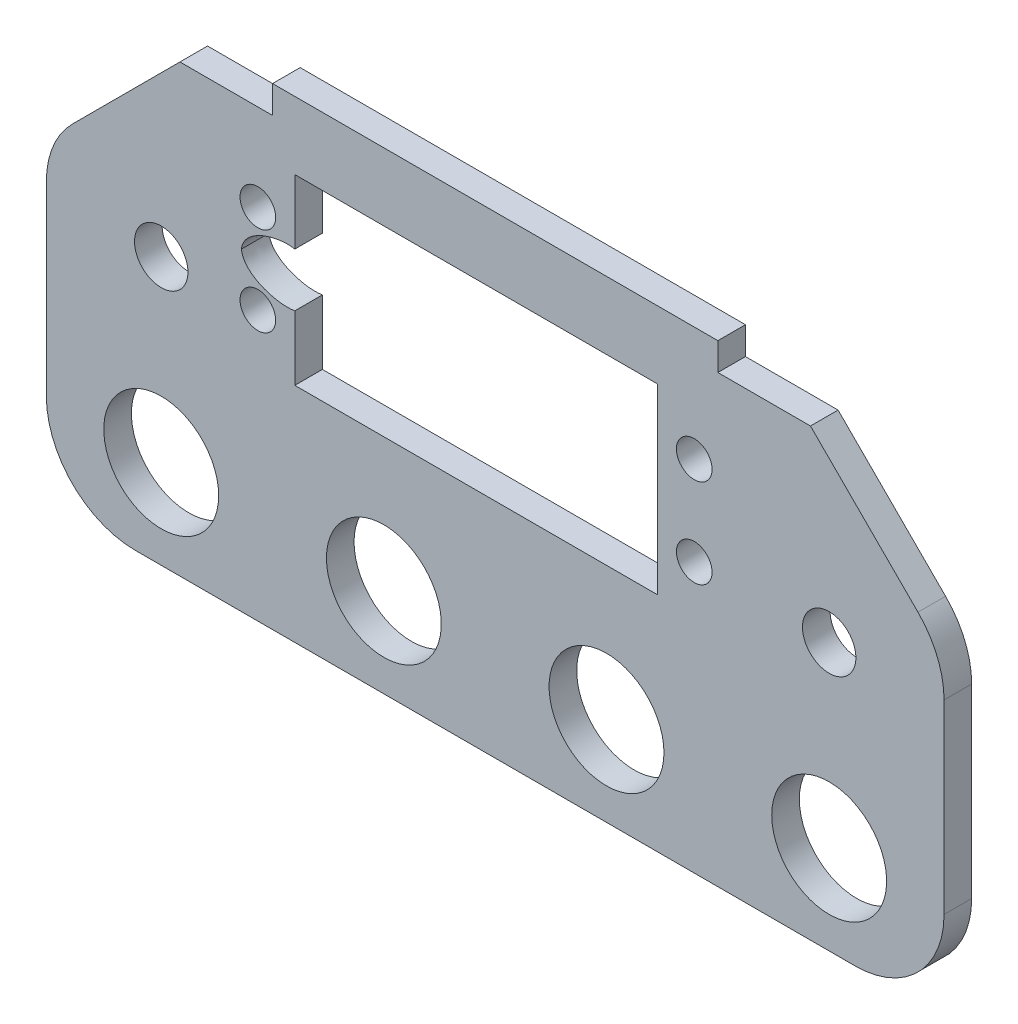
ISO-10303-21;
HEADER;
FILE_DESCRIPTION(('STEP AP214'),'2;1');
FILE_NAME('part.step','',(''),(''),'','','');
FILE_SCHEMA(('AUTOMOTIVE_DESIGN { 1 0 10303 214 1 1 1 1 }'));
ENDSEC;
DATA;
#1=APPLICATION_CONTEXT('core data for automotive mechanical design processes');
#2=APPLICATION_PROTOCOL_DEFINITION('international standard','automotive_design',2000,#1);
#3=PRODUCT_CONTEXT('',#1,'mechanical');
#4=PRODUCT('Part','Part','',(#3));
#5=PRODUCT_RELATED_PRODUCT_CATEGORY('part','',(#4));
#6=PRODUCT_DEFINITION_FORMATION('','',#4);
#7=PRODUCT_DEFINITION_CONTEXT('part definition',#1,'design');
#8=PRODUCT_DEFINITION('design','',#6,#7);
#9=PRODUCT_DEFINITION_SHAPE('','',#8);
#10=(LENGTH_UNIT() NAMED_UNIT(*) SI_UNIT(.MILLI.,.METRE.));
#11=(NAMED_UNIT(*) PLANE_ANGLE_UNIT() SI_UNIT($,.RADIAN.));
#12=(NAMED_UNIT(*) SI_UNIT($,.STERADIAN.) SOLID_ANGLE_UNIT());
#13=UNCERTAINTY_MEASURE_WITH_UNIT(LENGTH_MEASURE(1.E-05),#10,'distance_accuracy_value','');
#14=(GEOMETRIC_REPRESENTATION_CONTEXT(3) GLOBAL_UNCERTAINTY_ASSIGNED_CONTEXT((#13)) GLOBAL_UNIT_ASSIGNED_CONTEXT((#10,
#11,#12)) REPRESENTATION_CONTEXT('',''));
#15=CARTESIAN_POINT('',(0.,0.,0.));
#16=DIRECTION('',(0.,0.,1.));
#17=DIRECTION('',(1.,0.,0.));
#18=AXIS2_PLACEMENT_3D('',#15,#16,#17);
#19=CARTESIAN_POINT('',(-0.399999987385364,44.9992058139719,3.1));
#20=DIRECTION('',(0.,-1.,0.));
#21=DIRECTION('',(1.,0.,0.));
#22=AXIS2_PLACEMENT_3D('',#19,#20,#21);
#23=PLANE('',#22);
#24=DIRECTION('',(-1.,0.,0.));
#25=VECTOR('',#24,1.);
#26=CARTESIAN_POINT('',(-0.399999987385364,44.9992058139719,0.));
#27=LINE('',#26,#25);
#28=CARTESIAN_POINT('',(-25.0000000000001,44.9992058139719,0.));
#29=VERTEX_POINT('',#28);
#30=CARTESIAN_POINT('',(-35.3999999873853,44.9992058139719,0.));
#31=VERTEX_POINT('',#30);
#32=EDGE_CURVE('E189',#29,#31,#27,.T.);
#33=ORIENTED_EDGE('',*,*,#32,.T.);
#34=DIRECTION('',(0.,0.,1.));
#35=VECTOR('',#34,1.);
#36=CARTESIAN_POINT('',(-35.3999999873853,44.9992058139719,3.1));
#37=LINE('',#36,#35);
#38=CARTESIAN_POINT('',(-35.3999999873853,44.9992058139719,3.1));
#39=VERTEX_POINT('',#38);
#40=EDGE_CURVE('E230',#31,#39,#37,.T.);
#41=ORIENTED_EDGE('',*,*,#40,.T.);
#42=DIRECTION('',(-1.,0.,0.));
#43=VECTOR('',#42,1.);
#44=CARTESIAN_POINT('',(19.6000000126146,44.9992058139719,3.1));
#45=LINE('',#44,#43);
#46=CARTESIAN_POINT('',(-25.0000000000001,44.9992058139719,3.1));
#47=VERTEX_POINT('',#46);
#48=EDGE_CURVE('E192',#47,#39,#45,.T.);
#49=ORIENTED_EDGE('',*,*,#48,.F.);
#50=DIRECTION('',(0.,0.,1.));
#51=VECTOR('',#50,1.);
#52=CARTESIAN_POINT('',(-25.0000000000001,44.9992058139719,0.));
#53=LINE('',#52,#51);
#54=EDGE_CURVE('E177',#29,#47,#53,.T.);
#55=ORIENTED_EDGE('',*,*,#54,.F.);
#56=EDGE_LOOP('',(#33,#41,#49,#55));
#57=FACE_BOUND('',#56,.T.);
#58=ADVANCED_FACE('F32',(#57),#23,.F.);
#59=CARTESIAN_POINT('',(0.,0.,3.1));
#60=DIRECTION('',(0.,0.,1.));
#61=DIRECTION('',(1.,0.,0.));
#62=AXIS2_PLACEMENT_3D('',#59,#60,#61);
#63=PLANE('',#62);
#64=CARTESIAN_POINT('',(-37.5,24.9992058139719,3.1));
#65=DIRECTION('',(0.,0.,1.));
#66=DIRECTION('',(1.,0.,0.));
#67=AXIS2_PLACEMENT_3D('',#64,#65,#66);
#68=CIRCLE('',#67,3.);
#69=CARTESIAN_POINT('',(-34.5,24.9992058139719,3.1));
#70=VERTEX_POINT('',#69);
#71=EDGE_CURVE('E761',#70,#70,#68,.T.);
#72=ORIENTED_EDGE('',*,*,#71,.F.);
#73=EDGE_LOOP('',(#72));
#74=FACE_BOUND('',#73,.T.);
#75=CARTESIAN_POINT('',(-26.65,25.2500000010362,3.1));
#76=DIRECTION('',(0.,0.,1.));
#77=DIRECTION('',(1.,0.,0.));
#78=AXIS2_PLACEMENT_3D('',#75,#76,#77);
#79=CIRCLE('',#78,2.00000000000001);
#80=CARTESIAN_POINT('',(-24.65,25.2500000010362,3.1));
#81=VERTEX_POINT('',#80);
#82=EDGE_CURVE('E773',#81,#81,#79,.T.);
#83=ORIENTED_EDGE('',*,*,#82,.F.);
#84=EDGE_LOOP('',(#83));
#85=FACE_BOUND('',#84,.T.);
#86=CARTESIAN_POINT('',(22.35,35.2500000010362,3.1));
#87=DIRECTION('',(0.,0.,1.));
#88=DIRECTION('',(1.,0.,0.));
#89=AXIS2_PLACEMENT_3D('',#86,#87,#88);
#90=CIRCLE('',#89,2.);
#91=CARTESIAN_POINT('',(24.35,35.2500000010362,3.1));
#92=VERTEX_POINT('',#91);
#93=EDGE_CURVE('E369',#92,#92,#90,.T.);
#94=ORIENTED_EDGE('',*,*,#93,.F.);
#95=EDGE_LOOP('',(#94));
#96=FACE_BOUND('',#95,.T.);
#97=CARTESIAN_POINT('',(-12.5,5.00000000103621,3.1));
#98=DIRECTION('',(0.,0.,1.));
#99=DIRECTION('',(-1.,0.,0.));
#100=AXIS2_PLACEMENT_3D('',#97,#98,#99);
#101=CIRCLE('',#100,6.45);
#102=CARTESIAN_POINT('',(-18.95,5.00000000103621,3.1));
#103=VERTEX_POINT('',#102);
#104=EDGE_CURVE('E312',#103,#103,#101,.T.);
#105=ORIENTED_EDGE('',*,*,#104,.F.);
#106=EDGE_LOOP('',(#105));
#107=FACE_BOUND('',#106,.T.);
#108=CARTESIAN_POINT('',(37.4999999873853,4.99920581397187,3.1));
#109=DIRECTION('',(0.,0.,1.));
#110=DIRECTION('',(-1.,0.,0.));
#111=AXIS2_PLACEMENT_3D('',#108,#109,#110);
#112=CIRCLE('',#111,6.45);
#113=CARTESIAN_POINT('',(31.0499999873853,4.99920581397187,3.1));
#114=VERTEX_POINT('',#113);
#115=EDGE_CURVE('E300',#114,#114,#112,.T.);
#116=ORIENTED_EDGE('',*,*,#115,.F.);
#117=EDGE_LOOP('',(#116));
#118=FACE_BOUND('',#117,.T.);
#119=DIRECTION('',(0.707106781186549,0.707106781186547,0.));
#120=VECTOR('',#119,1.);
#121=CARTESIAN_POINT('',(-40.1996029006785,40.1996029006786,3.1));
#122=LINE('',#121,#120);
#123=CARTESIAN_POINT('',(-47.4710677992508,32.9281380021064,3.1));
#124=VERTEX_POINT('',#123);
#125=EDGE_CURVE('E848',#39,#124,#122,.F.);
#126=ORIENTED_EDGE('',*,*,#125,.T.);
#127=CARTESIAN_POINT('',(-40.3999999873853,25.8570701902409,3.1));
#128=DIRECTION('',(0.,0.,1.));
#129=DIRECTION('',(1.,0.,0.));
#130=AXIS2_PLACEMENT_3D('',#127,#128,#129);
#131=CIRCLE('',#130,10.);
#132=CARTESIAN_POINT('',(-50.3999999873853,25.8570701902409,3.1));
#133=VERTEX_POINT('',#132);
#134=EDGE_CURVE('E290',#124,#133,#131,.T.);
#135=ORIENTED_EDGE('',*,*,#134,.T.);
#136=DIRECTION('',(0.,-1.,0.));
#137=VECTOR('',#136,1.);
#138=CARTESIAN_POINT('',(-50.3999999873853,-5.00079418602815,3.1));
#139=LINE('',#138,#137);
#140=CARTESIAN_POINT('',(-50.3999999873853,4.99920581397186,3.1));
#141=VERTEX_POINT('',#140);
#142=EDGE_CURVE('E204',#133,#141,#139,.T.);
#143=ORIENTED_EDGE('',*,*,#142,.T.);
#144=CARTESIAN_POINT('',(-40.3999999873853,4.99920581397185,3.1));
#145=DIRECTION('',(0.,0.,1.));
#146=DIRECTION('',(1.,0.,0.));
#147=AXIS2_PLACEMENT_3D('',#144,#145,#146);
#148=CIRCLE('',#147,10.);
#149=CARTESIAN_POINT('',(-40.3999999873853,-5.00079418602815,3.1));
#150=VERTEX_POINT('',#149);
#151=EDGE_CURVE('E269',#141,#150,#148,.T.);
#152=ORIENTED_EDGE('',*,*,#151,.T.);
#153=DIRECTION('',(1.,0.,0.));
#154=VECTOR('',#153,1.);
#155=CARTESIAN_POINT('',(50.3999999873853,-5.00079418602813,3.1));
#156=LINE('',#155,#154);
#157=CARTESIAN_POINT('',(40.3999999873853,-5.00079418602814,3.1));
#158=VERTEX_POINT('',#157);
#159=EDGE_CURVE('E294',#150,#158,#156,.T.);
#160=ORIENTED_EDGE('',*,*,#159,.T.);
#161=CARTESIAN_POINT('',(40.3999999873853,4.99920581397186,3.1));
#162=DIRECTION('',(0.,0.,1.));
#163=DIRECTION('',(1.,0.,0.));
#164=AXIS2_PLACEMENT_3D('',#161,#162,#163);
#165=CIRCLE('',#164,10.);
#166=CARTESIAN_POINT('',(50.3999999873853,4.99920581397186,3.1));
#167=VERTEX_POINT('',#166);
#168=EDGE_CURVE('E261',#158,#167,#165,.T.);
#169=ORIENTED_EDGE('',*,*,#168,.T.);
#170=DIRECTION('',(0.,1.,0.));
#171=VECTOR('',#170,1.);
#172=CARTESIAN_POINT('',(50.3999999873853,-5.00079418602813,3.1));
#173=LINE('',#172,#171);
#174=CARTESIAN_POINT('',(50.3999999873853,25.8570701902409,3.1));
#175=VERTEX_POINT('',#174);
#176=EDGE_CURVE('E239',#167,#175,#173,.T.);
#177=ORIENTED_EDGE('',*,*,#176,.T.);
#178=CARTESIAN_POINT('',(40.3999999873853,25.8570701902409,3.1));
#179=DIRECTION('',(0.,0.,1.));
#180=DIRECTION('',(1.,0.,0.));
#181=AXIS2_PLACEMENT_3D('',#178,#179,#180);
#182=CIRCLE('',#181,10.);
#183=CARTESIAN_POINT('',(47.4710677992508,32.9281380021064,3.1));
#184=VERTEX_POINT('',#183);
#185=EDGE_CURVE('E47',#175,#184,#182,.T.);
#186=ORIENTED_EDGE('',*,*,#185,.T.);
#187=DIRECTION('',(0.707106781186547,-0.707106781186548,0.));
#188=VECTOR('',#187,1.);
#189=CARTESIAN_POINT('',(40.1996029006786,40.1996029006786,3.1));
#190=LINE('',#189,#188);
#191=CARTESIAN_POINT('',(35.3999999873853,44.9992058139719,3.1));
#192=VERTEX_POINT('',#191);
#193=EDGE_CURVE('E232',#184,#192,#190,.F.);
#194=ORIENTED_EDGE('',*,*,#193,.T.);
#195=CARTESIAN_POINT('',(24.9999999999999,44.9992058139719,3.1));
#196=VERTEX_POINT('',#195);
#197=EDGE_CURVE('E233',#192,#196,#45,.T.);
#198=ORIENTED_EDGE('',*,*,#197,.T.);
#199=DIRECTION('',(0.,-1.,0.));
#200=VECTOR('',#199,1.);
#201=CARTESIAN_POINT('',(24.9999999999999,48.0992058139719,3.1));
#202=LINE('',#201,#200);
#203=CARTESIAN_POINT('',(24.9999999999999,48.0992058139719,3.1));
#204=VERTEX_POINT('',#203);
#205=EDGE_CURVE('E723',#204,#196,#202,.T.);
#206=ORIENTED_EDGE('',*,*,#205,.F.);
#207=DIRECTION('',(1.,0.,0.));
#208=VECTOR('',#207,1.);
#209=CARTESIAN_POINT('',(-25.0000000000001,48.0992058139719,3.1));
#210=LINE('',#209,#208);
#211=CARTESIAN_POINT('',(-25.0000000000001,48.0992058139719,3.1));
#212=VERTEX_POINT('',#211);
#213=EDGE_CURVE('E184',#212,#204,#210,.T.);
#214=ORIENTED_EDGE('',*,*,#213,.F.);
#215=DIRECTION('',(0.,-1.,0.));
#216=VECTOR('',#215,1.);
#217=CARTESIAN_POINT('',(-25.0000000000001,48.0992058139719,3.1));
#218=LINE('',#217,#216);
#219=EDGE_CURVE('E729',#212,#47,#218,.T.);
#220=ORIENTED_EDGE('',*,*,#219,.T.);
#221=ORIENTED_EDGE('',*,*,#48,.T.);
#222=EDGE_LOOP('',(#126,#135,#143,#152,#160,#169,#177,#186,#194,#198,#206,#214,#220,#221));
#223=FACE_BOUND('',#222,.T.);
#224=CARTESIAN_POINT('',(12.5,5.00000000103621,3.1));
#225=DIRECTION('',(0.,0.,1.));
#226=DIRECTION('',(1.,0.,0.));
#227=AXIS2_PLACEMENT_3D('',#224,#225,#226);
#228=CIRCLE('',#227,6.45);
#229=CARTESIAN_POINT('',(18.95,5.00000000103621,3.1));
#230=VERTEX_POINT('',#229);
#231=EDGE_CURVE('E243',#230,#230,#228,.T.);
#232=ORIENTED_EDGE('',*,*,#231,.F.);
#233=EDGE_LOOP('',(#232));
#234=FACE_BOUND('',#233,.T.);
#235=CARTESIAN_POINT('',(-37.4999999873853,4.99920581397186,3.1));
#236=DIRECTION('',(0.,0.,1.));
#237=DIRECTION('',(1.,0.,0.));
#238=AXIS2_PLACEMENT_3D('',#235,#236,#237);
#239=CIRCLE('',#238,6.45);
#240=CARTESIAN_POINT('',(-31.0499999873853,4.99920581397186,3.1));
#241=VERTEX_POINT('',#240);
#242=EDGE_CURVE('E306',#241,#241,#239,.T.);
#243=ORIENTED_EDGE('',*,*,#242,.F.);
#244=EDGE_LOOP('',(#243));
#245=FACE_BOUND('',#244,.T.);
#246=DIRECTION('',(-1.,0.,0.));
#247=VECTOR('',#246,1.);
#248=CARTESIAN_POINT('',(-22.5,40.5000000010362,3.1));
#249=LINE('',#248,#247);
#250=CARTESIAN_POINT('',(18.2,40.5000000010362,3.1));
#251=VERTEX_POINT('',#250);
#252=CARTESIAN_POINT('',(-22.5,40.5000000010362,3.1));
#253=VERTEX_POINT('',#252);
#254=EDGE_CURVE('E790',#251,#253,#249,.T.);
#255=ORIENTED_EDGE('',*,*,#254,.F.);
#256=DIRECTION('',(0.,1.,0.));
#257=VECTOR('',#256,1.);
#258=CARTESIAN_POINT('',(18.2,20.0000000010362,3.1));
#259=LINE('',#258,#257);
#260=CARTESIAN_POINT('',(18.2,20.0000000010362,3.1));
#261=VERTEX_POINT('',#260);
#262=EDGE_CURVE('E340',#261,#251,#259,.T.);
#263=ORIENTED_EDGE('',*,*,#262,.F.);
#264=DIRECTION('',(1.,0.,0.));
#265=VECTOR('',#264,1.);
#266=CARTESIAN_POINT('',(-22.5,20.0000000010362,3.1));
#267=LINE('',#266,#265);
#268=CARTESIAN_POINT('',(-22.5,20.0000000010362,3.1));
#269=VERTEX_POINT('',#268);
#270=EDGE_CURVE('E336',#269,#261,#267,.T.);
#271=ORIENTED_EDGE('',*,*,#270,.F.);
#272=DIRECTION('',(0.,-1.,0.));
#273=VECTOR('',#272,1.);
#274=CARTESIAN_POINT('',(-22.5,27.2500000010362,3.1));
#275=LINE('',#274,#273);
#276=CARTESIAN_POINT('',(-22.5,27.2500000010362,3.1));
#277=VERTEX_POINT('',#276);
#278=EDGE_CURVE('E371',#277,#269,#275,.T.);
#279=ORIENTED_EDGE('',*,*,#278,.F.);
#280=CARTESIAN_POINT('',(-28.5,30.2500000010362,3.1));
#281=CARTESIAN_POINT('',(-28.2119824644761,27.8950203496147,3.1));
#282=CARTESIAN_POINT('',(-24.3130045122564,26.8884658170141,3.1));
#283=CARTESIAN_POINT('',(-22.5,27.2500000010362,3.1));
#284=B_SPLINE_CURVE_WITH_KNOTS('',3,(#280,#281,#282,#283),.UNSPECIFIED.,.F.,.F.,(4,4),(0.,1.),.UNSPECIFIED.);
#285=CARTESIAN_POINT('',(-28.5,30.2500000010362,3.1));
#286=VERTEX_POINT('',#285);
#287=EDGE_CURVE('E374',#286,#277,#284,.T.);
#288=ORIENTED_EDGE('',*,*,#287,.F.);
#289=CARTESIAN_POINT('',(-22.5,33.2500000010362,3.1));
#290=CARTESIAN_POINT('',(-24.3130045122564,33.6115341850583,3.1));
#291=CARTESIAN_POINT('',(-28.2119824644761,32.6049796524578,3.1));
#292=CARTESIAN_POINT('',(-28.5,30.2500000010362,3.1));
#293=B_SPLINE_CURVE_WITH_KNOTS('',3,(#289,#290,#291,#292),.UNSPECIFIED.,.F.,.F.,(4,4),(0.,1.),.UNSPECIFIED.);
#294=CARTESIAN_POINT('',(-22.5,33.2500000010362,3.1));
#295=VERTEX_POINT('',#294);
#296=EDGE_CURVE('E379',#295,#286,#293,.T.);
#297=ORIENTED_EDGE('',*,*,#296,.F.);
#298=DIRECTION('',(0.,-1.,0.));
#299=VECTOR('',#298,1.);
#300=CARTESIAN_POINT('',(-22.5,33.2500000010362,3.1));
#301=LINE('',#300,#299);
#302=EDGE_CURVE('E791',#253,#295,#301,.T.);
#303=ORIENTED_EDGE('',*,*,#302,.F.);
#304=EDGE_LOOP('',(#255,#263,#271,#279,#288,#297,#303));
#305=FACE_BOUND('',#304,.T.);
#306=CARTESIAN_POINT('',(22.35,25.2500000010362,3.1));
#307=DIRECTION('',(0.,0.,1.));
#308=DIRECTION('',(-1.,0.,0.));
#309=AXIS2_PLACEMENT_3D('',#306,#307,#308);
#310=CIRCLE('',#309,2.);
#311=CARTESIAN_POINT('',(20.35,25.2500000010362,3.1));
#312=VERTEX_POINT('',#311);
#313=EDGE_CURVE('E779',#312,#312,#310,.T.);
#314=ORIENTED_EDGE('',*,*,#313,.F.);
#315=EDGE_LOOP('',(#314));
#316=FACE_BOUND('',#315,.T.);
#317=CARTESIAN_POINT('',(-26.65,35.2500000010362,3.1));
#318=DIRECTION('',(0.,0.,1.));
#319=DIRECTION('',(-1.,0.,0.));
#320=AXIS2_PLACEMENT_3D('',#317,#318,#319);
#321=CIRCLE('',#320,2.00000000000001);
#322=CARTESIAN_POINT('',(-28.65,35.2500000010362,3.1));
#323=VERTEX_POINT('',#322);
#324=EDGE_CURVE('E767',#323,#323,#321,.T.);
#325=ORIENTED_EDGE('',*,*,#324,.F.);
#326=EDGE_LOOP('',(#325));
#327=FACE_BOUND('',#326,.T.);
#328=CARTESIAN_POINT('',(37.5,24.9992058139719,3.1));
#329=DIRECTION('',(0.,0.,1.));
#330=DIRECTION('',(-1.,0.,0.));
#331=AXIS2_PLACEMENT_3D('',#328,#329,#330);
#332=CIRCLE('',#331,3.);
#333=CARTESIAN_POINT('',(34.5,24.9992058139719,3.1));
#334=VERTEX_POINT('',#333);
#335=EDGE_CURVE('E746',#334,#334,#332,.T.);
#336=ORIENTED_EDGE('',*,*,#335,.F.);
#337=EDGE_LOOP('',(#336));
#338=FACE_BOUND('',#337,.T.);
#339=ADVANCED_FACE('F292',(#74,#85,#96,#107,#118,#223,#234,#245,#305,#316,#327,#338),#63,.T.);
#340=CARTESIAN_POINT('',(0.,0.,0.));
#341=DIRECTION('',(0.,0.,1.));
#342=DIRECTION('',(1.,0.,0.));
#343=AXIS2_PLACEMENT_3D('',#340,#341,#342);
#344=PLANE('',#343);
#345=CARTESIAN_POINT('',(-37.5,24.9992058139719,0.));
#346=DIRECTION('',(0.,0.,1.));
#347=DIRECTION('',(1.,0.,0.));
#348=AXIS2_PLACEMENT_3D('',#345,#346,#347);
#349=CIRCLE('',#348,3.);
#350=CARTESIAN_POINT('',(-34.5,24.9992058139719,0.));
#351=VERTEX_POINT('',#350);
#352=EDGE_CURVE('E759',#351,#351,#349,.T.);
#353=ORIENTED_EDGE('',*,*,#352,.T.);
#354=EDGE_LOOP('',(#353));
#355=FACE_BOUND('',#354,.T.);
#356=CARTESIAN_POINT('',(-26.65,25.2500000010362,0.));
#357=DIRECTION('',(0.,0.,1.));
#358=DIRECTION('',(1.,0.,0.));
#359=AXIS2_PLACEMENT_3D('',#356,#357,#358);
#360=CIRCLE('',#359,2.00000000000001);
#361=CARTESIAN_POINT('',(-24.65,25.2500000010362,0.));
#362=VERTEX_POINT('',#361);
#363=EDGE_CURVE('E770',#362,#362,#360,.T.);
#364=ORIENTED_EDGE('',*,*,#363,.T.);
#365=EDGE_LOOP('',(#364));
#366=FACE_BOUND('',#365,.T.);
#367=CARTESIAN_POINT('',(22.35,35.2500000010362,0.));
#368=DIRECTION('',(0.,0.,1.));
#369=DIRECTION('',(1.,0.,0.));
#370=AXIS2_PLACEMENT_3D('',#367,#368,#369);
#371=CIRCLE('',#370,2.);
#372=CARTESIAN_POINT('',(24.35,35.2500000010362,0.));
#373=VERTEX_POINT('',#372);
#374=EDGE_CURVE('E782',#373,#373,#371,.T.);
#375=ORIENTED_EDGE('',*,*,#374,.T.);
#376=EDGE_LOOP('',(#375));
#377=FACE_BOUND('',#376,.T.);
#378=CARTESIAN_POINT('',(-12.5,5.00000000103621,0.));
#379=DIRECTION('',(0.,0.,1.));
#380=DIRECTION('',(-1.,0.,0.));
#381=AXIS2_PLACEMENT_3D('',#378,#379,#380);
#382=CIRCLE('',#381,6.45);
#383=CARTESIAN_POINT('',(-18.95,5.00000000103621,0.));
#384=VERTEX_POINT('',#383);
#385=EDGE_CURVE('E315',#384,#384,#382,.T.);
#386=ORIENTED_EDGE('',*,*,#385,.T.);
#387=EDGE_LOOP('',(#386));
#388=FACE_BOUND('',#387,.T.);
#389=CARTESIAN_POINT('',(37.4999999873853,4.99920581397187,0.));
#390=DIRECTION('',(0.,0.,1.));
#391=DIRECTION('',(-1.,0.,0.));
#392=AXIS2_PLACEMENT_3D('',#389,#390,#391);
#393=CIRCLE('',#392,6.45);
#394=CARTESIAN_POINT('',(31.0499999873853,4.99920581397187,0.));
#395=VERTEX_POINT('',#394);
#396=EDGE_CURVE('E303',#395,#395,#393,.T.);
#397=ORIENTED_EDGE('',*,*,#396,.T.);
#398=EDGE_LOOP('',(#397));
#399=FACE_BOUND('',#398,.T.);
#400=DIRECTION('',(0.,-1.,0.));
#401=VECTOR('',#400,1.);
#402=CARTESIAN_POINT('',(-50.3999999873853,-5.00079418602815,0.));
#403=LINE('',#402,#401);
#404=CARTESIAN_POINT('',(-50.3999999873853,25.8570701902409,0.));
#405=VERTEX_POINT('',#404);
#406=CARTESIAN_POINT('',(-50.3999999873853,4.99920581397186,0.));
#407=VERTEX_POINT('',#406);
#408=EDGE_CURVE('E241',#405,#407,#403,.T.);
#409=ORIENTED_EDGE('',*,*,#408,.F.);
#410=CARTESIAN_POINT('',(-40.3999999873853,25.8570701902409,0.));
#411=DIRECTION('',(0.,0.,1.));
#412=DIRECTION('',(1.,0.,0.));
#413=AXIS2_PLACEMENT_3D('',#410,#411,#412);
#414=CIRCLE('',#413,10.);
#415=CARTESIAN_POINT('',(-47.4710677992508,32.9281380021064,0.));
#416=VERTEX_POINT('',#415);
#417=EDGE_CURVE('E278',#405,#416,#414,.F.);
#418=ORIENTED_EDGE('',*,*,#417,.T.);
#419=DIRECTION('',(-0.707106781186549,-0.707106781186547,0.));
#420=VECTOR('',#419,1.);
#421=CARTESIAN_POINT('',(-50.3999999873853,29.9992058139719,0.));
#422=LINE('',#421,#420);
#423=EDGE_CURVE('E200',#416,#31,#422,.F.);
#424=ORIENTED_EDGE('',*,*,#423,.T.);
#425=ORIENTED_EDGE('',*,*,#32,.F.);
#426=DIRECTION('',(0.,-1.,0.));
#427=VECTOR('',#426,1.);
#428=CARTESIAN_POINT('',(-25.0000000000001,48.0992058139719,0.));
#429=LINE('',#428,#427);
#430=CARTESIAN_POINT('',(-25.0000000000001,48.0992058139719,0.));
#431=VERTEX_POINT('',#430);
#432=EDGE_CURVE('E173',#431,#29,#429,.T.);
#433=ORIENTED_EDGE('',*,*,#432,.F.);
#434=DIRECTION('',(1.,0.,0.));
#435=VECTOR('',#434,1.);
#436=CARTESIAN_POINT('',(-25.0000000000001,48.0992058139719,0.));
#437=LINE('',#436,#435);
#438=CARTESIAN_POINT('',(24.9999999999999,48.0992058139719,0.));
#439=VERTEX_POINT('',#438);
#440=EDGE_CURVE('E194',#431,#439,#437,.T.);
#441=ORIENTED_EDGE('',*,*,#440,.T.);
#442=DIRECTION('',(0.,-1.,0.));
#443=VECTOR('',#442,1.);
#444=CARTESIAN_POINT('',(24.9999999999999,48.0992058139719,0.));
#445=LINE('',#444,#443);
#446=CARTESIAN_POINT('',(24.9999999999999,44.9992058139719,0.));
#447=VERTEX_POINT('',#446);
#448=EDGE_CURVE('E183',#439,#447,#445,.T.);
#449=ORIENTED_EDGE('',*,*,#448,.T.);
#450=CARTESIAN_POINT('',(35.3999999873853,44.9992058139719,0.));
#451=VERTEX_POINT('',#450);
#452=EDGE_CURVE('E201',#451,#447,#27,.T.);
#453=ORIENTED_EDGE('',*,*,#452,.F.);
#454=DIRECTION('',(-0.707106781186547,0.707106781186548,0.));
#455=VECTOR('',#454,1.);
#456=CARTESIAN_POINT('',(35.3999999873853,44.9992058139719,0.));
#457=LINE('',#456,#455);
#458=CARTESIAN_POINT('',(47.4710677992508,32.9281380021064,0.));
#459=VERTEX_POINT('',#458);
#460=EDGE_CURVE('E226',#451,#459,#457,.F.);
#461=ORIENTED_EDGE('',*,*,#460,.T.);
#462=CARTESIAN_POINT('',(40.3999999873853,25.8570701902409,0.));
#463=DIRECTION('',(0.,0.,1.));
#464=DIRECTION('',(1.,0.,0.));
#465=AXIS2_PLACEMENT_3D('',#462,#463,#464);
#466=CIRCLE('',#465,10.);
#467=CARTESIAN_POINT('',(50.3999999873853,25.8570701902409,0.));
#468=VERTEX_POINT('',#467);
#469=EDGE_CURVE('E276',#459,#468,#466,.F.);
#470=ORIENTED_EDGE('',*,*,#469,.T.);
#471=DIRECTION('',(0.,1.,0.));
#472=VECTOR('',#471,1.);
#473=CARTESIAN_POINT('',(50.3999999873853,-5.00079418602813,0.));
#474=LINE('',#473,#472);
#475=CARTESIAN_POINT('',(50.3999999873853,4.99920581397186,0.));
#476=VERTEX_POINT('',#475);
#477=EDGE_CURVE('E202',#476,#468,#474,.T.);
#478=ORIENTED_EDGE('',*,*,#477,.F.);
#479=CARTESIAN_POINT('',(40.3999999873853,4.99920581397186,0.));
#480=DIRECTION('',(0.,0.,1.));
#481=DIRECTION('',(1.,0.,0.));
#482=AXIS2_PLACEMENT_3D('',#479,#480,#481);
#483=CIRCLE('',#482,10.);
#484=CARTESIAN_POINT('',(40.3999999873853,-5.00079418602814,0.));
#485=VERTEX_POINT('',#484);
#486=EDGE_CURVE('E259',#476,#485,#483,.F.);
#487=ORIENTED_EDGE('',*,*,#486,.T.);
#488=DIRECTION('',(1.,0.,0.));
#489=VECTOR('',#488,1.);
#490=CARTESIAN_POINT('',(50.3999999873853,-5.00079418602813,0.));
#491=LINE('',#490,#489);
#492=CARTESIAN_POINT('',(-40.3999999873853,-5.00079418602815,0.));
#493=VERTEX_POINT('',#492);
#494=EDGE_CURVE('E207',#493,#485,#491,.T.);
#495=ORIENTED_EDGE('',*,*,#494,.F.);
#496=CARTESIAN_POINT('',(-40.3999999873853,4.99920581397185,0.));
#497=DIRECTION('',(0.,0.,1.));
#498=DIRECTION('',(1.,0.,0.));
#499=AXIS2_PLACEMENT_3D('',#496,#497,#498);
#500=CIRCLE('',#499,10.);
#501=EDGE_CURVE('E262',#493,#407,#500,.F.);
#502=ORIENTED_EDGE('',*,*,#501,.T.);
#503=EDGE_LOOP('',(#409,#418,#424,#425,#433,#441,#449,#453,#461,#470,#478,#487,#495,#502));
#504=FACE_BOUND('',#503,.T.);
#505=CARTESIAN_POINT('',(12.5,5.00000000103621,0.));
#506=DIRECTION('',(0.,0.,1.));
#507=DIRECTION('',(1.,0.,0.));
#508=AXIS2_PLACEMENT_3D('',#505,#506,#507);
#509=CIRCLE('',#508,6.45);
#510=CARTESIAN_POINT('',(18.95,5.00000000103621,0.));
#511=VERTEX_POINT('',#510);
#512=EDGE_CURVE('E297',#511,#511,#509,.T.);
#513=ORIENTED_EDGE('',*,*,#512,.T.);
#514=EDGE_LOOP('',(#513));
#515=FACE_BOUND('',#514,.T.);
#516=CARTESIAN_POINT('',(-37.4999999873853,4.99920581397186,0.));
#517=DIRECTION('',(0.,0.,1.));
#518=DIRECTION('',(1.,0.,0.));
#519=AXIS2_PLACEMENT_3D('',#516,#517,#518);
#520=CIRCLE('',#519,6.45);
#521=CARTESIAN_POINT('',(-31.0499999873853,4.99920581397186,0.));
#522=VERTEX_POINT('',#521);
#523=EDGE_CURVE('E309',#522,#522,#520,.T.);
#524=ORIENTED_EDGE('',*,*,#523,.T.);
#525=EDGE_LOOP('',(#524));
#526=FACE_BOUND('',#525,.T.);
#527=DIRECTION('',(0.,1.,0.));
#528=VECTOR('',#527,1.);
#529=CARTESIAN_POINT('',(18.2,20.0000000010362,0.));
#530=LINE('',#529,#528);
#531=CARTESIAN_POINT('',(18.2,20.0000000010362,0.));
#532=VERTEX_POINT('',#531);
#533=CARTESIAN_POINT('',(18.2,40.5000000010362,0.));
#534=VERTEX_POINT('',#533);
#535=EDGE_CURVE('E366',#532,#534,#530,.T.);
#536=ORIENTED_EDGE('',*,*,#535,.T.);
#537=DIRECTION('',(-1.,0.,0.));
#538=VECTOR('',#537,1.);
#539=CARTESIAN_POINT('',(-22.5,40.5000000010362,0.));
#540=LINE('',#539,#538);
#541=CARTESIAN_POINT('',(-22.5,40.5000000010362,0.));
#542=VERTEX_POINT('',#541);
#543=EDGE_CURVE('E363',#534,#542,#540,.T.);
#544=ORIENTED_EDGE('',*,*,#543,.T.);
#545=DIRECTION('',(0.,-1.,0.));
#546=VECTOR('',#545,1.);
#547=CARTESIAN_POINT('',(-22.5,33.2500000010362,0.));
#548=LINE('',#547,#546);
#549=CARTESIAN_POINT('',(-22.5,33.2500000010362,0.));
#550=VERTEX_POINT('',#549);
#551=EDGE_CURVE('E357',#542,#550,#548,.T.);
#552=ORIENTED_EDGE('',*,*,#551,.T.);
#553=CARTESIAN_POINT('',(-22.5,33.2500000010362,0.));
#554=CARTESIAN_POINT('',(-24.3130045122564,33.6115341850583,0.));
#555=CARTESIAN_POINT('',(-28.2119824644761,32.6049796524578,0.));
#556=CARTESIAN_POINT('',(-28.5,30.2500000010362,0.));
#557=B_SPLINE_CURVE_WITH_KNOTS('',3,(#553,#554,#555,#556),.UNSPECIFIED.,.F.,.F.,(4,4),(0.,1.),.UNSPECIFIED.);
#558=CARTESIAN_POINT('',(-28.5,30.2500000010362,0.));
#559=VERTEX_POINT('',#558);
#560=EDGE_CURVE('E349',#550,#559,#557,.T.);
#561=ORIENTED_EDGE('',*,*,#560,.T.);
#562=CARTESIAN_POINT('',(-28.5,30.2500000010362,0.));
#563=CARTESIAN_POINT('',(-28.2119824644761,27.8950203496147,0.));
#564=CARTESIAN_POINT('',(-24.3130045122564,26.8884658170141,0.));
#565=CARTESIAN_POINT('',(-22.5,27.2500000010362,0.));
#566=B_SPLINE_CURVE_WITH_KNOTS('',3,(#562,#563,#564,#565),.UNSPECIFIED.,.F.,.F.,(4,4),(0.,1.),.UNSPECIFIED.);
#567=CARTESIAN_POINT('',(-22.5,27.2500000010362,0.));
#568=VERTEX_POINT('',#567);
#569=EDGE_CURVE('E344',#559,#568,#566,.T.);
#570=ORIENTED_EDGE('',*,*,#569,.T.);
#571=DIRECTION('',(0.,-1.,0.));
#572=VECTOR('',#571,1.);
#573=CARTESIAN_POINT('',(-22.5,27.2500000010362,0.));
#574=LINE('',#573,#572);
#575=CARTESIAN_POINT('',(-22.5,20.0000000010362,0.));
#576=VERTEX_POINT('',#575);
#577=EDGE_CURVE('E341',#568,#576,#574,.T.);
#578=ORIENTED_EDGE('',*,*,#577,.T.);
#579=DIRECTION('',(1.,0.,0.));
#580=VECTOR('',#579,1.);
#581=CARTESIAN_POINT('',(-22.5,20.0000000010362,0.));
#582=LINE('',#581,#580);
#583=EDGE_CURVE('E337',#576,#532,#582,.T.);
#584=ORIENTED_EDGE('',*,*,#583,.T.);
#585=EDGE_LOOP('',(#536,#544,#552,#561,#570,#578,#584));
#586=FACE_BOUND('',#585,.T.);
#587=CARTESIAN_POINT('',(22.35,25.2500000010362,0.));
#588=DIRECTION('',(0.,0.,1.));
#589=DIRECTION('',(-1.,0.,0.));
#590=AXIS2_PLACEMENT_3D('',#587,#588,#589);
#591=CIRCLE('',#590,2.);
#592=CARTESIAN_POINT('',(20.35,25.2500000010362,0.));
#593=VERTEX_POINT('',#592);
#594=EDGE_CURVE('E776',#593,#593,#591,.T.);
#595=ORIENTED_EDGE('',*,*,#594,.T.);
#596=EDGE_LOOP('',(#595));
#597=FACE_BOUND('',#596,.T.);
#598=CARTESIAN_POINT('',(-26.65,35.2500000010362,0.));
#599=DIRECTION('',(0.,0.,1.));
#600=DIRECTION('',(-1.,0.,0.));
#601=AXIS2_PLACEMENT_3D('',#598,#599,#600);
#602=CIRCLE('',#601,2.00000000000001);
#603=CARTESIAN_POINT('',(-28.65,35.2500000010362,0.));
#604=VERTEX_POINT('',#603);
#605=EDGE_CURVE('E764',#604,#604,#602,.T.);
#606=ORIENTED_EDGE('',*,*,#605,.T.);
#607=EDGE_LOOP('',(#606));
#608=FACE_BOUND('',#607,.T.);
#609=CARTESIAN_POINT('',(37.5,24.9992058139719,0.));
#610=DIRECTION('',(0.,0.,1.));
#611=DIRECTION('',(-1.,0.,0.));
#612=AXIS2_PLACEMENT_3D('',#609,#610,#611);
#613=CIRCLE('',#612,3.);
#614=CARTESIAN_POINT('',(34.5,24.9992058139719,0.));
#615=VERTEX_POINT('',#614);
#616=EDGE_CURVE('E754',#615,#615,#613,.T.);
#617=ORIENTED_EDGE('',*,*,#616,.T.);
#618=EDGE_LOOP('',(#617));
#619=FACE_BOUND('',#618,.T.);
#620=ADVANCED_FACE('F197',(#355,#366,#377,#388,#399,#504,#515,#526,#586,#597,#608,#619),#344,.F.);
#621=CARTESIAN_POINT('',(-50.3999999873853,-5.00079418602815,3.1));
#622=DIRECTION('',(1.,0.,0.));
#623=DIRECTION('',(0.,1.,0.));
#624=AXIS2_PLACEMENT_3D('',#621,#622,#623);
#625=PLANE('',#624);
#626=ORIENTED_EDGE('',*,*,#142,.F.);
#627=DIRECTION('',(0.,0.,1.));
#628=VECTOR('',#627,1.);
#629=CARTESIAN_POINT('',(-50.3999999873853,25.8570701902409,0.));
#630=LINE('',#629,#628);
#631=EDGE_CURVE('E279',#133,#405,#630,.F.);
#632=ORIENTED_EDGE('',*,*,#631,.T.);
#633=ORIENTED_EDGE('',*,*,#408,.T.);
#634=DIRECTION('',(0.,0.,-1.));
#635=VECTOR('',#634,1.);
#636=CARTESIAN_POINT('',(-50.3999999873853,4.99920581397186,3.1));
#637=LINE('',#636,#635);
#638=EDGE_CURVE('E266',#407,#141,#637,.F.);
#639=ORIENTED_EDGE('',*,*,#638,.T.);
#640=EDGE_LOOP('',(#626,#632,#633,#639));
#641=FACE_BOUND('',#640,.T.);
#642=ADVANCED_FACE('F433',(#641),#625,.F.);
#643=CARTESIAN_POINT('',(50.3999999873853,-5.00079418602813,3.1));
#644=DIRECTION('',(0.,1.,0.));
#645=DIRECTION('',(-1.,0.,0.));
#646=AXIS2_PLACEMENT_3D('',#643,#644,#645);
#647=PLANE('',#646);
#648=ORIENTED_EDGE('',*,*,#159,.F.);
#649=DIRECTION('',(0.,0.,-1.));
#650=VECTOR('',#649,1.);
#651=CARTESIAN_POINT('',(-40.3999999873853,-5.00079418602815,3.1));
#652=LINE('',#651,#650);
#653=EDGE_CURVE('E253',#150,#493,#652,.T.);
#654=ORIENTED_EDGE('',*,*,#653,.T.);
#655=ORIENTED_EDGE('',*,*,#494,.T.);
#656=DIRECTION('',(0.,0.,-1.));
#657=VECTOR('',#656,1.);
#658=CARTESIAN_POINT('',(40.3999999873853,-5.00079418602814,3.1));
#659=LINE('',#658,#657);
#660=EDGE_CURVE('E219',#485,#158,#659,.F.);
#661=ORIENTED_EDGE('',*,*,#660,.T.);
#662=EDGE_LOOP('',(#648,#654,#655,#661));
#663=FACE_BOUND('',#662,.T.);
#664=ADVANCED_FACE('F250',(#663),#647,.F.);
#665=CARTESIAN_POINT('',(50.3999999873853,-5.00079418602813,3.1));
#666=DIRECTION('',(-1.,0.,0.));
#667=DIRECTION('',(0.,-1.,0.));
#668=AXIS2_PLACEMENT_3D('',#665,#666,#667);
#669=PLANE('',#668);
#670=ORIENTED_EDGE('',*,*,#477,.T.);
#671=DIRECTION('',(0.,0.,-1.));
#672=VECTOR('',#671,1.);
#673=CARTESIAN_POINT('',(50.3999999873853,25.8570701902409,3.1));
#674=LINE('',#673,#672);
#675=EDGE_CURVE('E40',#468,#175,#674,.F.);
#676=ORIENTED_EDGE('',*,*,#675,.T.);
#677=ORIENTED_EDGE('',*,*,#176,.F.);
#678=DIRECTION('',(0.,0.,-1.));
#679=VECTOR('',#678,1.);
#680=CARTESIAN_POINT('',(50.3999999873853,4.99920581397186,3.1));
#681=LINE('',#680,#679);
#682=EDGE_CURVE('E212',#167,#476,#681,.T.);
#683=ORIENTED_EDGE('',*,*,#682,.T.);
#684=EDGE_LOOP('',(#670,#676,#677,#683));
#685=FACE_BOUND('',#684,.T.);
#686=ADVANCED_FACE('F274',(#685),#669,.F.);
#687=ORIENTED_EDGE('',*,*,#197,.F.);
#688=DIRECTION('',(0.,0.,-1.));
#689=VECTOR('',#688,1.);
#690=CARTESIAN_POINT('',(35.3999999873853,44.9992058139719,3.1));
#691=LINE('',#690,#689);
#692=EDGE_CURVE('E284',#192,#451,#691,.T.);
#693=ORIENTED_EDGE('',*,*,#692,.T.);
#694=ORIENTED_EDGE('',*,*,#452,.T.);
#695=DIRECTION('',(0.,0.,1.));
#696=VECTOR('',#695,1.);
#697=CARTESIAN_POINT('',(24.9999999999999,44.9992058139719,0.));
#698=LINE('',#697,#696);
#699=EDGE_CURVE('E193',#447,#196,#698,.T.);
#700=ORIENTED_EDGE('',*,*,#699,.T.);
#701=EDGE_LOOP('',(#687,#693,#694,#700));
#702=FACE_BOUND('',#701,.T.);
#703=ADVANCED_FACE('F426',(#702),#23,.F.);
#704=CARTESIAN_POINT('',(12.5,5.00000000103621,3.1));
#705=DIRECTION('',(0.,0.,-1.));
#706=DIRECTION('',(-1.,0.,0.));
#707=AXIS2_PLACEMENT_3D('',#704,#705,#706);
#708=CYLINDRICAL_SURFACE('',#707,6.45);
#709=ORIENTED_EDGE('',*,*,#231,.T.);
#710=EDGE_LOOP('',(#709));
#711=FACE_BOUND('',#710,.T.);
#712=ORIENTED_EDGE('',*,*,#512,.F.);
#713=EDGE_LOOP('',(#712));
#714=FACE_BOUND('',#713,.T.);
#715=ADVANCED_FACE('F422',(#711,#714),#708,.F.);
#716=CARTESIAN_POINT('',(37.4999999873853,4.99920581397187,3.1));
#717=DIRECTION('',(0.,0.,-1.));
#718=DIRECTION('',(-1.,0.,0.));
#719=AXIS2_PLACEMENT_3D('',#716,#717,#718);
#720=CYLINDRICAL_SURFACE('',#719,6.45);
#721=ORIENTED_EDGE('',*,*,#115,.T.);
#722=EDGE_LOOP('',(#721));
#723=FACE_BOUND('',#722,.T.);
#724=ORIENTED_EDGE('',*,*,#396,.F.);
#725=EDGE_LOOP('',(#724));
#726=FACE_BOUND('',#725,.T.);
#727=ADVANCED_FACE('F418',(#723,#726),#720,.F.);
#728=CARTESIAN_POINT('',(-37.4999999873853,4.99920581397186,3.1));
#729=DIRECTION('',(0.,0.,-1.));
#730=DIRECTION('',(-1.,0.,0.));
#731=AXIS2_PLACEMENT_3D('',#728,#729,#730);
#732=CYLINDRICAL_SURFACE('',#731,6.45);
#733=ORIENTED_EDGE('',*,*,#242,.T.);
#734=EDGE_LOOP('',(#733));
#735=FACE_BOUND('',#734,.T.);
#736=ORIENTED_EDGE('',*,*,#523,.F.);
#737=EDGE_LOOP('',(#736));
#738=FACE_BOUND('',#737,.T.);
#739=ADVANCED_FACE('F414',(#735,#738),#732,.F.);
#740=CARTESIAN_POINT('',(-12.5,5.00000000103621,3.1));
#741=DIRECTION('',(0.,0.,-1.));
#742=DIRECTION('',(-1.,0.,0.));
#743=AXIS2_PLACEMENT_3D('',#740,#741,#742);
#744=CYLINDRICAL_SURFACE('',#743,6.45);
#745=ORIENTED_EDGE('',*,*,#104,.T.);
#746=EDGE_LOOP('',(#745));
#747=FACE_BOUND('',#746,.T.);
#748=ORIENTED_EDGE('',*,*,#385,.F.);
#749=EDGE_LOOP('',(#748));
#750=FACE_BOUND('',#749,.T.);
#751=ADVANCED_FACE('F410',(#747,#750),#744,.F.);
#752=CARTESIAN_POINT('',(18.2,20.0000000010362,3.1));
#753=DIRECTION('',(-1.,0.,0.));
#754=DIRECTION('',(0.,0.,1.));
#755=AXIS2_PLACEMENT_3D('',#752,#753,#754);
#756=PLANE('',#755);
#757=ORIENTED_EDGE('',*,*,#535,.F.);
#758=DIRECTION('',(0.,0.,-1.));
#759=VECTOR('',#758,1.);
#760=CARTESIAN_POINT('',(18.2,20.0000000010362,3.1));
#761=LINE('',#760,#759);
#762=EDGE_CURVE('E333',#261,#532,#761,.T.);
#763=ORIENTED_EDGE('',*,*,#762,.F.);
#764=ORIENTED_EDGE('',*,*,#262,.T.);
#765=DIRECTION('',(0.,0.,-1.));
#766=VECTOR('',#765,1.);
#767=CARTESIAN_POINT('',(18.2,40.5000000010362,3.1));
#768=LINE('',#767,#766);
#769=EDGE_CURVE('E318',#251,#534,#768,.T.);
#770=ORIENTED_EDGE('',*,*,#769,.T.);
#771=EDGE_LOOP('',(#757,#763,#764,#770));
#772=FACE_BOUND('',#771,.T.);
#773=ADVANCED_FACE('F406',(#772),#756,.T.);
#774=CARTESIAN_POINT('',(-22.5,40.5000000010362,3.1));
#775=DIRECTION('',(0.,-1.,0.));
#776=DIRECTION('',(0.,0.,-1.));
#777=AXIS2_PLACEMENT_3D('',#774,#775,#776);
#778=PLANE('',#777);
#779=ORIENTED_EDGE('',*,*,#543,.F.);
#780=ORIENTED_EDGE('',*,*,#769,.F.);
#781=ORIENTED_EDGE('',*,*,#254,.T.);
#782=DIRECTION('',(0.,0.,-1.));
#783=VECTOR('',#782,1.);
#784=CARTESIAN_POINT('',(-22.5,40.5000000010362,3.1));
#785=LINE('',#784,#783);
#786=EDGE_CURVE('E323',#253,#542,#785,.T.);
#787=ORIENTED_EDGE('',*,*,#786,.T.);
#788=EDGE_LOOP('',(#779,#780,#781,#787));
#789=FACE_BOUND('',#788,.T.);
#790=ADVANCED_FACE('F402',(#789),#778,.T.);
#791=CARTESIAN_POINT('',(-22.5,33.2500000010362,3.1));
#792=DIRECTION('',(1.,0.,0.));
#793=DIRECTION('',(0.,1.,0.));
#794=AXIS2_PLACEMENT_3D('',#791,#792,#793);
#795=PLANE('',#794);
#796=ORIENTED_EDGE('',*,*,#551,.F.);
#797=ORIENTED_EDGE('',*,*,#786,.F.);
#798=ORIENTED_EDGE('',*,*,#302,.T.);
#799=DIRECTION('',(0.,0.,-1.));
#800=VECTOR('',#799,1.);
#801=CARTESIAN_POINT('',(-22.5,33.2500000010362,3.1));
#802=LINE('',#801,#800);
#803=EDGE_CURVE('E325',#295,#550,#802,.T.);
#804=ORIENTED_EDGE('',*,*,#803,.T.);
#805=EDGE_LOOP('',(#796,#797,#798,#804));
#806=FACE_BOUND('',#805,.T.);
#807=ADVANCED_FACE('F398',(#806),#795,.T.);
#808=DIRECTION('',(0.,0.,-1.));
#809=VECTOR('',#808,1.);
#810=SURFACE_OF_LINEAR_EXTRUSION('',#293,#809);
#811=ORIENTED_EDGE('',*,*,#560,.F.);
#812=ORIENTED_EDGE('',*,*,#803,.F.);
#813=ORIENTED_EDGE('',*,*,#296,.T.);
#814=DIRECTION('',(0.,0.,-1.));
#815=VECTOR('',#814,1.);
#816=CARTESIAN_POINT('',(-28.5,30.2500000010362,3.1));
#817=LINE('',#816,#815);
#818=EDGE_CURVE('E327',#286,#559,#817,.T.);
#819=ORIENTED_EDGE('',*,*,#818,.T.);
#820=EDGE_LOOP('',(#811,#812,#813,#819));
#821=FACE_BOUND('',#820,.T.);
#822=ADVANCED_FACE('F393',(#821),#810,.T.);
#823=DIRECTION('',(0.,0.,-1.));
#824=VECTOR('',#823,1.);
#825=SURFACE_OF_LINEAR_EXTRUSION('',#284,#824);
#826=ORIENTED_EDGE('',*,*,#569,.F.);
#827=ORIENTED_EDGE('',*,*,#818,.F.);
#828=ORIENTED_EDGE('',*,*,#287,.T.);
#829=DIRECTION('',(0.,0.,-1.));
#830=VECTOR('',#829,1.);
#831=CARTESIAN_POINT('',(-22.5,27.2500000010362,3.1));
#832=LINE('',#831,#830);
#833=EDGE_CURVE('E329',#277,#568,#832,.T.);
#834=ORIENTED_EDGE('',*,*,#833,.T.);
#835=EDGE_LOOP('',(#826,#827,#828,#834));
#836=FACE_BOUND('',#835,.T.);
#837=ADVANCED_FACE('F388',(#836),#825,.T.);
#838=CARTESIAN_POINT('',(-22.5,27.2500000010362,3.1));
#839=DIRECTION('',(1.,0.,0.));
#840=DIRECTION('',(0.,0.,-1.));
#841=AXIS2_PLACEMENT_3D('',#838,#839,#840);
#842=PLANE('',#841);
#843=ORIENTED_EDGE('',*,*,#577,.F.);
#844=ORIENTED_EDGE('',*,*,#833,.F.);
#845=ORIENTED_EDGE('',*,*,#278,.T.);
#846=DIRECTION('',(0.,0.,-1.));
#847=VECTOR('',#846,1.);
#848=CARTESIAN_POINT('',(-22.5,20.0000000010362,3.1));
#849=LINE('',#848,#847);
#850=EDGE_CURVE('E331',#269,#576,#849,.T.);
#851=ORIENTED_EDGE('',*,*,#850,.T.);
#852=EDGE_LOOP('',(#843,#844,#845,#851));
#853=FACE_BOUND('',#852,.T.);
#854=ADVANCED_FACE('F392',(#853),#842,.T.);
#855=CARTESIAN_POINT('',(-22.5,20.0000000010362,3.1));
#856=DIRECTION('',(0.,1.,0.));
#857=DIRECTION('',(0.,0.,1.));
#858=AXIS2_PLACEMENT_3D('',#855,#856,#857);
#859=PLANE('',#858);
#860=ORIENTED_EDGE('',*,*,#583,.F.);
#861=ORIENTED_EDGE('',*,*,#850,.F.);
#862=ORIENTED_EDGE('',*,*,#270,.T.);
#863=ORIENTED_EDGE('',*,*,#762,.T.);
#864=EDGE_LOOP('',(#860,#861,#862,#863));
#865=FACE_BOUND('',#864,.T.);
#866=ADVANCED_FACE('F540',(#865),#859,.T.);
#867=CARTESIAN_POINT('',(22.35,35.2500000010362,3.1));
#868=DIRECTION('',(0.,0.,-1.));
#869=DIRECTION('',(-1.,0.,0.));
#870=AXIS2_PLACEMENT_3D('',#867,#868,#869);
#871=CYLINDRICAL_SURFACE('',#870,2.);
#872=ORIENTED_EDGE('',*,*,#93,.T.);
#873=EDGE_LOOP('',(#872));
#874=FACE_BOUND('',#873,.T.);
#875=ORIENTED_EDGE('',*,*,#374,.F.);
#876=EDGE_LOOP('',(#875));
#877=FACE_BOUND('',#876,.T.);
#878=ADVANCED_FACE('F547',(#874,#877),#871,.F.);
#879=CARTESIAN_POINT('',(22.35,25.2500000010362,3.1));
#880=DIRECTION('',(0.,0.,-1.));
#881=DIRECTION('',(-1.,0.,0.));
#882=AXIS2_PLACEMENT_3D('',#879,#880,#881);
#883=CYLINDRICAL_SURFACE('',#882,2.);
#884=ORIENTED_EDGE('',*,*,#313,.T.);
#885=EDGE_LOOP('',(#884));
#886=FACE_BOUND('',#885,.T.);
#887=ORIENTED_EDGE('',*,*,#594,.F.);
#888=EDGE_LOOP('',(#887));
#889=FACE_BOUND('',#888,.T.);
#890=ADVANCED_FACE('F554',(#886,#889),#883,.F.);
#891=CARTESIAN_POINT('',(-26.65,25.2500000010362,3.1));
#892=DIRECTION('',(0.,0.,-1.));
#893=DIRECTION('',(-1.,0.,0.));
#894=AXIS2_PLACEMENT_3D('',#891,#892,#893);
#895=CYLINDRICAL_SURFACE('',#894,2.00000000000001);
#896=ORIENTED_EDGE('',*,*,#82,.T.);
#897=EDGE_LOOP('',(#896));
#898=FACE_BOUND('',#897,.T.);
#899=ORIENTED_EDGE('',*,*,#363,.F.);
#900=EDGE_LOOP('',(#899));
#901=FACE_BOUND('',#900,.T.);
#902=ADVANCED_FACE('F562',(#898,#901),#895,.F.);
#903=CARTESIAN_POINT('',(-26.65,35.2500000010362,3.1));
#904=DIRECTION('',(0.,0.,-1.));
#905=DIRECTION('',(-1.,0.,0.));
#906=AXIS2_PLACEMENT_3D('',#903,#904,#905);
#907=CYLINDRICAL_SURFACE('',#906,2.00000000000001);
#908=ORIENTED_EDGE('',*,*,#324,.T.);
#909=EDGE_LOOP('',(#908));
#910=FACE_BOUND('',#909,.T.);
#911=ORIENTED_EDGE('',*,*,#605,.F.);
#912=EDGE_LOOP('',(#911));
#913=FACE_BOUND('',#912,.T.);
#914=ADVANCED_FACE('F570',(#910,#913),#907,.F.);
#915=CARTESIAN_POINT('',(-37.5,24.9992058139719,3.1));
#916=DIRECTION('',(0.,0.,-1.));
#917=DIRECTION('',(-1.,0.,0.));
#918=AXIS2_PLACEMENT_3D('',#915,#916,#917);
#919=CYLINDRICAL_SURFACE('',#918,3.);
#920=ORIENTED_EDGE('',*,*,#71,.T.);
#921=EDGE_LOOP('',(#920));
#922=FACE_BOUND('',#921,.T.);
#923=ORIENTED_EDGE('',*,*,#352,.F.);
#924=EDGE_LOOP('',(#923));
#925=FACE_BOUND('',#924,.T.);
#926=ADVANCED_FACE('F578',(#922,#925),#919,.F.);
#927=CARTESIAN_POINT('',(37.5,24.9992058139719,3.1));
#928=DIRECTION('',(0.,0.,-1.));
#929=DIRECTION('',(-1.,0.,0.));
#930=AXIS2_PLACEMENT_3D('',#927,#928,#929);
#931=CYLINDRICAL_SURFACE('',#930,3.);
#932=ORIENTED_EDGE('',*,*,#335,.T.);
#933=EDGE_LOOP('',(#932));
#934=FACE_BOUND('',#933,.T.);
#935=ORIENTED_EDGE('',*,*,#616,.F.);
#936=EDGE_LOOP('',(#935));
#937=FACE_BOUND('',#936,.T.);
#938=ADVANCED_FACE('F448',(#934,#937),#931,.F.);
#939=CARTESIAN_POINT('',(-40.3999999873853,4.99920581397185,3.1));
#940=DIRECTION('',(0.,0.,-1.));
#941=DIRECTION('',(-1.,0.,0.));
#942=AXIS2_PLACEMENT_3D('',#939,#940,#941);
#943=CYLINDRICAL_SURFACE('',#942,10.);
#944=ORIENTED_EDGE('',*,*,#151,.F.);
#945=ORIENTED_EDGE('',*,*,#638,.F.);
#946=ORIENTED_EDGE('',*,*,#501,.F.);
#947=ORIENTED_EDGE('',*,*,#653,.F.);
#948=EDGE_LOOP('',(#944,#945,#946,#947));
#949=FACE_BOUND('',#948,.T.);
#950=ADVANCED_FACE('F445',(#949),#943,.T.);
#951=CARTESIAN_POINT('',(40.3999999873853,4.99920581397186,3.1));
#952=DIRECTION('',(0.,0.,-1.));
#953=DIRECTION('',(-1.,0.,0.));
#954=AXIS2_PLACEMENT_3D('',#951,#952,#953);
#955=CYLINDRICAL_SURFACE('',#954,10.);
#956=ORIENTED_EDGE('',*,*,#168,.F.);
#957=ORIENTED_EDGE('',*,*,#660,.F.);
#958=ORIENTED_EDGE('',*,*,#486,.F.);
#959=ORIENTED_EDGE('',*,*,#682,.F.);
#960=EDGE_LOOP('',(#956,#957,#958,#959));
#961=FACE_BOUND('',#960,.T.);
#962=ADVANCED_FACE('F257',(#961),#955,.T.);
#963=CARTESIAN_POINT('',(-25.0000000000001,48.0992058139719,0.));
#964=DIRECTION('',(-1.,0.,0.));
#965=DIRECTION('',(0.,0.,1.));
#966=AXIS2_PLACEMENT_3D('',#963,#964,#965);
#967=PLANE('',#966);
#968=ORIENTED_EDGE('',*,*,#219,.F.);
#969=DIRECTION('',(0.,0.,1.));
#970=VECTOR('',#969,1.);
#971=CARTESIAN_POINT('',(-25.0000000000001,48.0992058139719,0.));
#972=LINE('',#971,#970);
#973=EDGE_CURVE('E179',#431,#212,#972,.T.);
#974=ORIENTED_EDGE('',*,*,#973,.F.);
#975=ORIENTED_EDGE('',*,*,#432,.T.);
#976=ORIENTED_EDGE('',*,*,#54,.T.);
#977=EDGE_LOOP('',(#968,#974,#975,#976));
#978=FACE_BOUND('',#977,.T.);
#979=ADVANCED_FACE('F176',(#978),#967,.T.);
#980=CARTESIAN_POINT('',(-25.0000000000001,48.0992058139719,0.));
#981=DIRECTION('',(0.,-1.,0.));
#982=DIRECTION('',(0.,0.,-1.));
#983=AXIS2_PLACEMENT_3D('',#980,#981,#982);
#984=PLANE('',#983);
#985=ORIENTED_EDGE('',*,*,#213,.T.);
#986=DIRECTION('',(0.,0.,1.));
#987=VECTOR('',#986,1.);
#988=CARTESIAN_POINT('',(24.9999999999999,48.0992058139719,0.));
#989=LINE('',#988,#987);
#990=EDGE_CURVE('E727',#439,#204,#989,.T.);
#991=ORIENTED_EDGE('',*,*,#990,.F.);
#992=ORIENTED_EDGE('',*,*,#440,.F.);
#993=ORIENTED_EDGE('',*,*,#973,.T.);
#994=EDGE_LOOP('',(#985,#991,#992,#993));
#995=FACE_BOUND('',#994,.T.);
#996=ADVANCED_FACE('F606',(#995),#984,.F.);
#997=CARTESIAN_POINT('',(24.9999999999999,48.0992058139719,0.));
#998=DIRECTION('',(-1.,0.,0.));
#999=DIRECTION('',(0.,-1.,0.));
#1000=AXIS2_PLACEMENT_3D('',#997,#998,#999);
#1001=PLANE('',#1000);
#1002=ORIENTED_EDGE('',*,*,#205,.T.);
#1003=ORIENTED_EDGE('',*,*,#699,.F.);
#1004=ORIENTED_EDGE('',*,*,#448,.F.);
#1005=ORIENTED_EDGE('',*,*,#990,.T.);
#1006=EDGE_LOOP('',(#1002,#1003,#1004,#1005));
#1007=FACE_BOUND('',#1006,.T.);
#1008=ADVANCED_FACE('F456',(#1007),#1001,.F.);
#1009=CARTESIAN_POINT('',(-50.3999999873853,29.9992058139719,3.1));
#1010=DIRECTION('',(0.707106781186547,-0.707106781186549,0.));
#1011=DIRECTION('',(0.,0.,-1.));
#1012=AXIS2_PLACEMENT_3D('',#1009,#1010,#1011);
#1013=PLANE('',#1012);
#1014=ORIENTED_EDGE('',*,*,#423,.F.);
#1015=DIRECTION('',(0.,0.,-1.));
#1016=VECTOR('',#1015,1.);
#1017=CARTESIAN_POINT('',(-47.4710677992508,32.9281380021064,3.1));
#1018=LINE('',#1017,#1016);
#1019=EDGE_CURVE('E281',#416,#124,#1018,.F.);
#1020=ORIENTED_EDGE('',*,*,#1019,.T.);
#1021=ORIENTED_EDGE('',*,*,#125,.F.);
#1022=ORIENTED_EDGE('',*,*,#40,.F.);
#1023=EDGE_LOOP('',(#1014,#1020,#1021,#1022));
#1024=FACE_BOUND('',#1023,.T.);
#1025=ADVANCED_FACE('F452',(#1024),#1013,.F.);
#1026=CARTESIAN_POINT('',(35.3999999873853,44.9992058139719,3.1));
#1027=DIRECTION('',(-0.707106781186548,-0.707106781186547,0.));
#1028=DIRECTION('',(0.,0.,-1.));
#1029=AXIS2_PLACEMENT_3D('',#1026,#1027,#1028);
#1030=PLANE('',#1029);
#1031=ORIENTED_EDGE('',*,*,#193,.F.);
#1032=DIRECTION('',(0.,0.,1.));
#1033=VECTOR('',#1032,1.);
#1034=CARTESIAN_POINT('',(47.4710677992508,32.9281380021064,0.));
#1035=LINE('',#1034,#1033);
#1036=EDGE_CURVE('E11',#184,#459,#1035,.F.);
#1037=ORIENTED_EDGE('',*,*,#1036,.T.);
#1038=ORIENTED_EDGE('',*,*,#460,.F.);
#1039=ORIENTED_EDGE('',*,*,#692,.F.);
#1040=EDGE_LOOP('',(#1031,#1037,#1038,#1039));
#1041=FACE_BOUND('',#1040,.T.);
#1042=ADVANCED_FACE('F455',(#1041),#1030,.F.);
#1043=CARTESIAN_POINT('',(-40.3999999873853,25.8570701902409,3.1));
#1044=DIRECTION('',(0.,0.,-1.));
#1045=DIRECTION('',(-1.,0.,0.));
#1046=AXIS2_PLACEMENT_3D('',#1043,#1044,#1045);
#1047=CYLINDRICAL_SURFACE('',#1046,10.);
#1048=ORIENTED_EDGE('',*,*,#134,.F.);
#1049=ORIENTED_EDGE('',*,*,#1019,.F.);
#1050=ORIENTED_EDGE('',*,*,#417,.F.);
#1051=ORIENTED_EDGE('',*,*,#631,.F.);
#1052=EDGE_LOOP('',(#1048,#1049,#1050,#1051));
#1053=FACE_BOUND('',#1052,.T.);
#1054=ADVANCED_FACE('F459',(#1053),#1047,.T.);
#1055=CARTESIAN_POINT('',(40.3999999873853,25.8570701902409,3.1));
#1056=DIRECTION('',(0.,0.,1.));
#1057=DIRECTION('',(1.,0.,0.));
#1058=AXIS2_PLACEMENT_3D('',#1055,#1056,#1057);
#1059=CYLINDRICAL_SURFACE('',#1058,10.);
#1060=ORIENTED_EDGE('',*,*,#469,.F.);
#1061=ORIENTED_EDGE('',*,*,#1036,.F.);
#1062=ORIENTED_EDGE('',*,*,#185,.F.);
#1063=ORIENTED_EDGE('',*,*,#675,.F.);
#1064=EDGE_LOOP('',(#1060,#1061,#1062,#1063));
#1065=FACE_BOUND('',#1064,.T.);
#1066=ADVANCED_FACE('F34',(#1065),#1059,.T.);
#1067=CLOSED_SHELL('',(#58,#339,#620,#642,#664,#686,#703,#715,#727,#739,#751,#773,#790,#807,
#822,#837,#854,#866,#878,#890,#902,#914,#926,#938,#950,#962,#979,#996,#1008,#1025,#1042,#1054,#1066));
#1068=MANIFOLD_SOLID_BREP('B2',#1067);
#1069=ADVANCED_BREP_SHAPE_REPRESENTATION('',(#18,#1068),#14);
#1070=SHAPE_DEFINITION_REPRESENTATION(#9,#1069);
ENDSEC;
END-ISO-10303-21;
